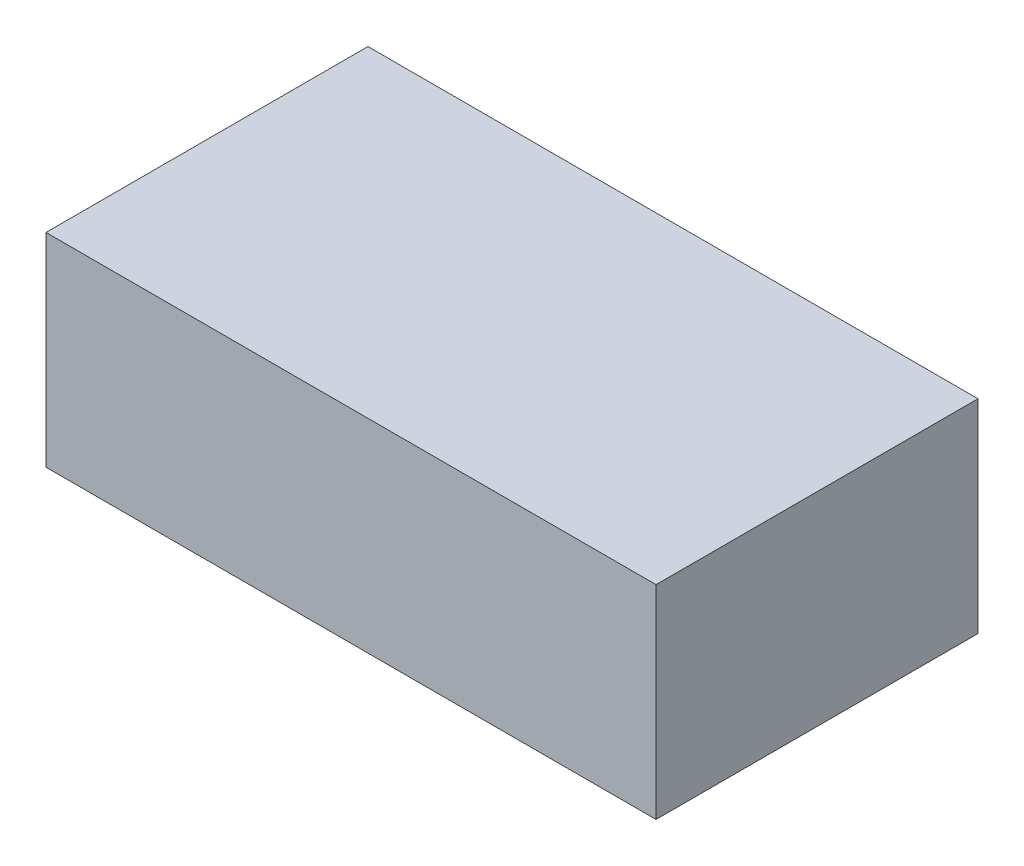
ISO-10303-21;
HEADER;
FILE_DESCRIPTION(('STEP AP214'),'2;1');
FILE_NAME('part.step','',(''),(''),'','','');
FILE_SCHEMA(('AUTOMOTIVE_DESIGN { 1 0 10303 214 1 1 1 1 }'));
ENDSEC;
DATA;
#1=APPLICATION_CONTEXT('core data for automotive mechanical design processes');
#2=APPLICATION_PROTOCOL_DEFINITION('international standard','automotive_design',2000,#1);
#3=PRODUCT_CONTEXT('',#1,'mechanical');
#4=PRODUCT('Part','Part','',(#3));
#5=PRODUCT_RELATED_PRODUCT_CATEGORY('part','',(#4));
#6=PRODUCT_DEFINITION_FORMATION('','',#4);
#7=PRODUCT_DEFINITION_CONTEXT('part definition',#1,'design');
#8=PRODUCT_DEFINITION('design','',#6,#7);
#9=PRODUCT_DEFINITION_SHAPE('','',#8);
#10=(LENGTH_UNIT() NAMED_UNIT(*) SI_UNIT(.MILLI.,.METRE.));
#11=(NAMED_UNIT(*) PLANE_ANGLE_UNIT() SI_UNIT($,.RADIAN.));
#12=(NAMED_UNIT(*) SI_UNIT($,.STERADIAN.) SOLID_ANGLE_UNIT());
#13=UNCERTAINTY_MEASURE_WITH_UNIT(LENGTH_MEASURE(1.E-05),#10,'distance_accuracy_value','');
#14=(GEOMETRIC_REPRESENTATION_CONTEXT(3) GLOBAL_UNCERTAINTY_ASSIGNED_CONTEXT((#13)) GLOBAL_UNIT_ASSIGNED_CONTEXT((#10,
#11,#12)) REPRESENTATION_CONTEXT('',''));
#15=CARTESIAN_POINT('',(0.,0.,0.));
#16=DIRECTION('',(0.,0.,1.));
#17=DIRECTION('',(1.,0.,0.));
#18=AXIS2_PLACEMENT_3D('',#15,#16,#17);
#19=CARTESIAN_POINT('',(0.,30.48,0.));
#20=DIRECTION('',(1.,0.,0.));
#21=DIRECTION('',(0.,0.,-1.));
#22=AXIS2_PLACEMENT_3D('',#19,#20,#21);
#23=PLANE('',#22);
#24=DIRECTION('',(0.,0.,1.));
#25=VECTOR('',#24,1.);
#26=CARTESIAN_POINT('',(0.,0.,0.));
#27=LINE('',#26,#25);
#28=CARTESIAN_POINT('',(0.,0.,-48.26));
#29=VERTEX_POINT('',#28);
#30=CARTESIAN_POINT('',(0.,0.,0.));
#31=VERTEX_POINT('',#30);
#32=EDGE_CURVE('E100',#29,#31,#27,.T.);
#33=ORIENTED_EDGE('',*,*,#32,.T.);
#34=DIRECTION('',(0.,-1.,0.));
#35=VECTOR('',#34,1.);
#36=CARTESIAN_POINT('',(0.,30.48,0.));
#37=LINE('',#36,#35);
#38=CARTESIAN_POINT('',(0.,30.48,0.));
#39=VERTEX_POINT('',#38);
#40=EDGE_CURVE('E11',#39,#31,#37,.T.);
#41=ORIENTED_EDGE('',*,*,#40,.F.);
#42=DIRECTION('',(0.,0.,1.));
#43=VECTOR('',#42,1.);
#44=CARTESIAN_POINT('',(0.,30.48,0.));
#45=LINE('',#44,#43);
#46=CARTESIAN_POINT('',(0.,30.48,-48.26));
#47=VERTEX_POINT('',#46);
#48=EDGE_CURVE('E88',#47,#39,#45,.T.);
#49=ORIENTED_EDGE('',*,*,#48,.F.);
#50=DIRECTION('',(0.,-1.,0.));
#51=VECTOR('',#50,1.);
#52=CARTESIAN_POINT('',(0.,30.48,-48.26));
#53=LINE('',#52,#51);
#54=EDGE_CURVE('E96',#47,#29,#53,.T.);
#55=ORIENTED_EDGE('',*,*,#54,.T.);
#56=EDGE_LOOP('',(#33,#41,#49,#55));
#57=FACE_BOUND('',#56,.T.);
#58=ADVANCED_FACE('F37',(#57),#23,.F.);
#59=CARTESIAN_POINT('',(0.,30.48,0.));
#60=DIRECTION('',(0.,0.,-1.));
#61=DIRECTION('',(-1.,0.,0.));
#62=AXIS2_PLACEMENT_3D('',#59,#60,#61);
#63=PLANE('',#62);
#64=DIRECTION('',(1.,0.,0.));
#65=VECTOR('',#64,1.);
#66=CARTESIAN_POINT('',(0.,0.,0.));
#67=LINE('',#66,#65);
#68=CARTESIAN_POINT('',(91.44,0.,0.));
#69=VERTEX_POINT('',#68);
#70=EDGE_CURVE('E92',#31,#69,#67,.T.);
#71=ORIENTED_EDGE('',*,*,#70,.T.);
#72=DIRECTION('',(0.,-1.,0.));
#73=VECTOR('',#72,1.);
#74=CARTESIAN_POINT('',(91.44,30.48,0.));
#75=LINE('',#74,#73);
#76=CARTESIAN_POINT('',(91.44,30.48,0.));
#77=VERTEX_POINT('',#76);
#78=EDGE_CURVE('E45',#77,#69,#75,.T.);
#79=ORIENTED_EDGE('',*,*,#78,.F.);
#80=DIRECTION('',(1.,0.,0.));
#81=VECTOR('',#80,1.);
#82=CARTESIAN_POINT('',(0.,30.48,0.));
#83=LINE('',#82,#81);
#84=EDGE_CURVE('E83',#39,#77,#83,.T.);
#85=ORIENTED_EDGE('',*,*,#84,.F.);
#86=ORIENTED_EDGE('',*,*,#40,.T.);
#87=EDGE_LOOP('',(#71,#79,#85,#86));
#88=FACE_BOUND('',#87,.T.);
#89=ADVANCED_FACE('F91',(#88),#63,.F.);
#90=CARTESIAN_POINT('',(91.44,30.48,0.));
#91=DIRECTION('',(-1.,0.,0.));
#92=DIRECTION('',(0.,0.,1.));
#93=AXIS2_PLACEMENT_3D('',#90,#91,#92);
#94=PLANE('',#93);
#95=DIRECTION('',(0.,0.,-1.));
#96=VECTOR('',#95,1.);
#97=CARTESIAN_POINT('',(91.44,0.,0.));
#98=LINE('',#97,#96);
#99=CARTESIAN_POINT('',(91.44,0.,-48.26));
#100=VERTEX_POINT('',#99);
#101=EDGE_CURVE('E70',#69,#100,#98,.T.);
#102=ORIENTED_EDGE('',*,*,#101,.T.);
#103=DIRECTION('',(0.,-1.,0.));
#104=VECTOR('',#103,1.);
#105=CARTESIAN_POINT('',(91.44,30.48,-48.26));
#106=LINE('',#105,#104);
#107=CARTESIAN_POINT('',(91.44,30.48,-48.26));
#108=VERTEX_POINT('',#107);
#109=EDGE_CURVE('E93',#108,#100,#106,.T.);
#110=ORIENTED_EDGE('',*,*,#109,.F.);
#111=DIRECTION('',(0.,0.,-1.));
#112=VECTOR('',#111,1.);
#113=CARTESIAN_POINT('',(91.44,30.48,0.));
#114=LINE('',#113,#112);
#115=EDGE_CURVE('E86',#77,#108,#114,.T.);
#116=ORIENTED_EDGE('',*,*,#115,.F.);
#117=ORIENTED_EDGE('',*,*,#78,.T.);
#118=EDGE_LOOP('',(#102,#110,#116,#117));
#119=FACE_BOUND('',#118,.T.);
#120=ADVANCED_FACE('F94',(#119),#94,.F.);
#121=CARTESIAN_POINT('',(0.,30.48,-48.26));
#122=DIRECTION('',(0.,0.,1.));
#123=DIRECTION('',(1.,0.,0.));
#124=AXIS2_PLACEMENT_3D('',#121,#122,#123);
#125=PLANE('',#124);
#126=DIRECTION('',(-1.,0.,0.));
#127=VECTOR('',#126,1.);
#128=CARTESIAN_POINT('',(0.,0.,-48.26));
#129=LINE('',#128,#127);
#130=EDGE_CURVE('E76',#100,#29,#129,.T.);
#131=ORIENTED_EDGE('',*,*,#130,.T.);
#132=ORIENTED_EDGE('',*,*,#54,.F.);
#133=DIRECTION('',(-1.,0.,0.));
#134=VECTOR('',#133,1.);
#135=CARTESIAN_POINT('',(0.,30.48,-48.26));
#136=LINE('',#135,#134);
#137=EDGE_CURVE('E53',#108,#47,#136,.T.);
#138=ORIENTED_EDGE('',*,*,#137,.F.);
#139=ORIENTED_EDGE('',*,*,#109,.T.);
#140=EDGE_LOOP('',(#131,#132,#138,#139));
#141=FACE_BOUND('',#140,.T.);
#142=ADVANCED_FACE('F107',(#141),#125,.F.);
#143=CARTESIAN_POINT('',(0.,30.48,0.));
#144=DIRECTION('',(0.,-1.,0.));
#145=DIRECTION('',(0.,0.,-1.));
#146=AXIS2_PLACEMENT_3D('',#143,#144,#145);
#147=PLANE('',#146);
#148=ORIENTED_EDGE('',*,*,#48,.T.);
#149=ORIENTED_EDGE('',*,*,#84,.T.);
#150=ORIENTED_EDGE('',*,*,#115,.T.);
#151=ORIENTED_EDGE('',*,*,#137,.T.);
#152=EDGE_LOOP('',(#148,#149,#150,#151));
#153=FACE_BOUND('',#152,.T.);
#154=ADVANCED_FACE('F84',(#153),#147,.F.);
#155=CARTESIAN_POINT('',(0.,0.,0.));
#156=DIRECTION('',(0.,-1.,0.));
#157=DIRECTION('',(0.,0.,-1.));
#158=AXIS2_PLACEMENT_3D('',#155,#156,#157);
#159=PLANE('',#158);
#160=ORIENTED_EDGE('',*,*,#32,.F.);
#161=ORIENTED_EDGE('',*,*,#130,.F.);
#162=ORIENTED_EDGE('',*,*,#101,.F.);
#163=ORIENTED_EDGE('',*,*,#70,.F.);
#164=EDGE_LOOP('',(#160,#161,#162,#163));
#165=FACE_BOUND('',#164,.T.);
#166=ADVANCED_FACE('F110',(#165),#159,.T.);
#167=CLOSED_SHELL('',(#58,#89,#120,#142,#154,#166));
#168=MANIFOLD_SOLID_BREP('B2',#167);
#169=ADVANCED_BREP_SHAPE_REPRESENTATION('',(#18,#168),#14);
#170=SHAPE_DEFINITION_REPRESENTATION(#9,#169);
ENDSEC;
END-ISO-10303-21;
